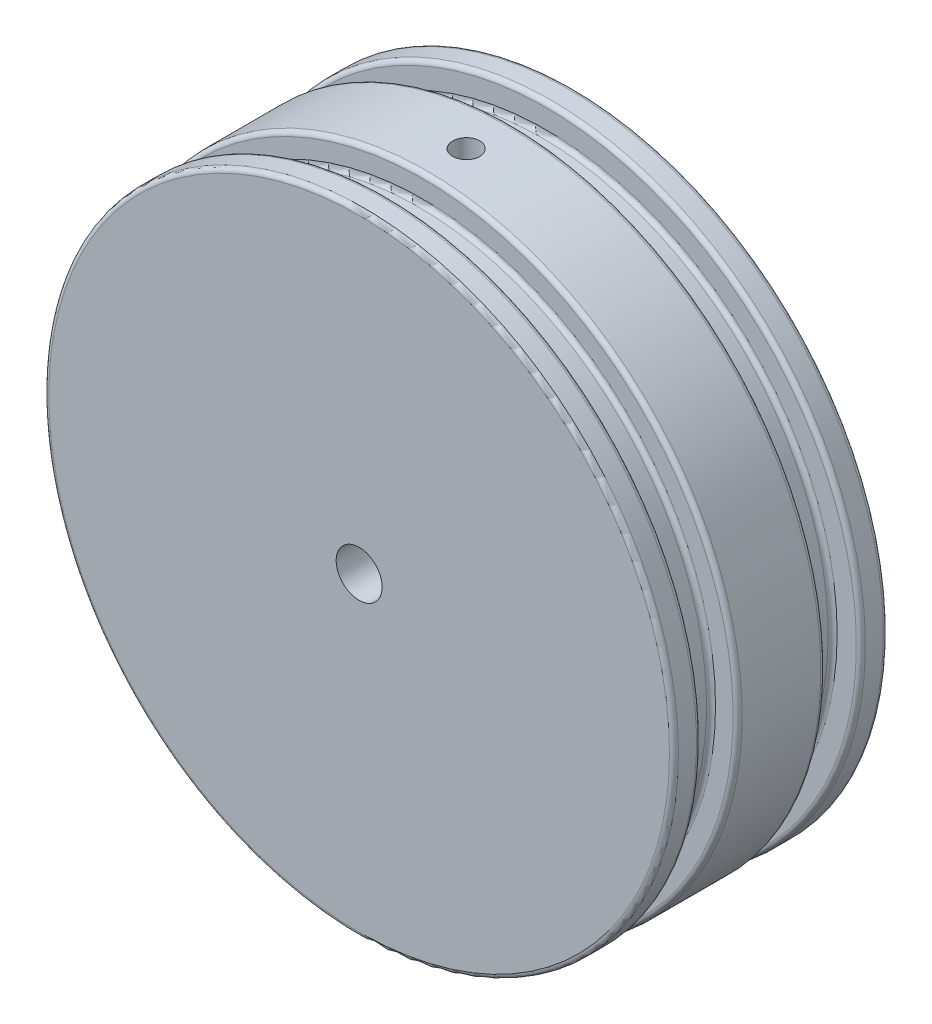
ISO-10303-21;
HEADER;
FILE_DESCRIPTION(('STEP AP214'),'2;1');
FILE_NAME('part.step','',(''),(''),'','','');
FILE_SCHEMA(('AUTOMOTIVE_DESIGN { 1 0 10303 214 1 1 1 1 }'));
ENDSEC;
DATA;
#1=APPLICATION_CONTEXT('core data for automotive mechanical design processes');
#2=APPLICATION_PROTOCOL_DEFINITION('international standard','automotive_design',2000,#1);
#3=PRODUCT_CONTEXT('',#1,'mechanical');
#4=PRODUCT('Part','Part','',(#3));
#5=PRODUCT_RELATED_PRODUCT_CATEGORY('part','',(#4));
#6=PRODUCT_DEFINITION_FORMATION('','',#4);
#7=PRODUCT_DEFINITION_CONTEXT('part definition',#1,'design');
#8=PRODUCT_DEFINITION('design','',#6,#7);
#9=PRODUCT_DEFINITION_SHAPE('','',#8);
#10=(LENGTH_UNIT() NAMED_UNIT(*) SI_UNIT(.MILLI.,.METRE.));
#11=(NAMED_UNIT(*) PLANE_ANGLE_UNIT() SI_UNIT($,.RADIAN.));
#12=(NAMED_UNIT(*) SI_UNIT($,.STERADIAN.) SOLID_ANGLE_UNIT());
#13=UNCERTAINTY_MEASURE_WITH_UNIT(LENGTH_MEASURE(1.E-05),#10,'distance_accuracy_value','');
#14=(GEOMETRIC_REPRESENTATION_CONTEXT(3) GLOBAL_UNCERTAINTY_ASSIGNED_CONTEXT((#13)) GLOBAL_UNIT_ASSIGNED_CONTEXT((#10,
#11,#12)) REPRESENTATION_CONTEXT('',''));
#15=CARTESIAN_POINT('',(0.,0.,0.));
#16=DIRECTION('',(0.,0.,1.));
#17=DIRECTION('',(1.,0.,0.));
#18=AXIS2_PLACEMENT_3D('',#15,#16,#17);
#19=CARTESIAN_POINT('',(0.,0.,20.));
#20=DIRECTION('',(0.,0.,-1.));
#21=DIRECTION('',(-1.,0.,0.));
#22=AXIS2_PLACEMENT_3D('',#19,#20,#21);
#23=CYLINDRICAL_SURFACE('',#22,69.9);
#24=CARTESIAN_POINT('',(0.,0.,19.));
#25=DIRECTION('',(0.,0.,1.));
#26=DIRECTION('',(1.,0.,0.));
#27=AXIS2_PLACEMENT_3D('',#24,#25,#26);
#28=CIRCLE('',#27,69.9);
#29=CARTESIAN_POINT('',(69.9,0.,19.));
#30=VERTEX_POINT('',#29);
#31=EDGE_CURVE('E106',#30,#30,#28,.F.);
#32=ORIENTED_EDGE('',*,*,#31,.T.);
#33=EDGE_LOOP('',(#32));
#34=FACE_BOUND('',#33,.T.);
#35=CARTESIAN_POINT('',(0.,0.,15.));
#36=DIRECTION('',(0.,0.,-1.));
#37=DIRECTION('',(-1.,0.,0.));
#38=AXIS2_PLACEMENT_3D('',#35,#36,#37);
#39=CIRCLE('',#38,69.9);
#40=CARTESIAN_POINT('',(-69.9,0.,15.));
#41=VERTEX_POINT('',#40);
#42=EDGE_CURVE('E103',#41,#41,#39,.F.);
#43=ORIENTED_EDGE('',*,*,#42,.T.);
#44=EDGE_LOOP('',(#43));
#45=FACE_BOUND('',#44,.T.);
#46=ADVANCED_FACE('F38',(#34,#45),#23,.T.);
#47=CARTESIAN_POINT('',(0.,0.,20.));
#48=DIRECTION('',(0.,0.,1.));
#49=DIRECTION('',(1.,0.,0.));
#50=AXIS2_PLACEMENT_3D('',#47,#48,#49);
#51=PLANE('',#50);
#52=CARTESIAN_POINT('',(0.,0.,20.));
#53=DIRECTION('',(0.,0.,1.));
#54=DIRECTION('',(1.,0.,0.));
#55=AXIS2_PLACEMENT_3D('',#52,#53,#54);
#56=CIRCLE('',#55,5.1);
#57=CARTESIAN_POINT('',(5.1,0.,20.));
#58=VERTEX_POINT('',#57);
#59=EDGE_CURVE('E76',#58,#58,#56,.T.);
#60=ORIENTED_EDGE('',*,*,#59,.F.);
#61=EDGE_LOOP('',(#60));
#62=FACE_BOUND('',#61,.T.);
#63=CARTESIAN_POINT('',(0.,0.,20.));
#64=DIRECTION('',(0.,0.,1.));
#65=DIRECTION('',(1.,0.,0.));
#66=AXIS2_PLACEMENT_3D('',#63,#64,#65);
#67=CIRCLE('',#66,68.9);
#68=CARTESIAN_POINT('',(68.9,0.,20.));
#69=VERTEX_POINT('',#68);
#70=EDGE_CURVE('E100',#69,#69,#67,.T.);
#71=ORIENTED_EDGE('',*,*,#70,.T.);
#72=EDGE_LOOP('',(#71));
#73=FACE_BOUND('',#72,.T.);
#74=ADVANCED_FACE('F201',(#62,#73),#51,.T.);
#75=CARTESIAN_POINT('',(0.,0.,5.87000000000001));
#76=DIRECTION('',(0.,0.,-1.));
#77=DIRECTION('',(-1.,0.,0.));
#78=AXIS2_PLACEMENT_3D('',#75,#76,#77);
#79=PLANE('',#78);
#80=CARTESIAN_POINT('',(0.,0.,5.87000000000001));
#81=DIRECTION('',(0.,0.,-1.));
#82=DIRECTION('',(-1.,0.,0.));
#83=AXIS2_PLACEMENT_3D('',#80,#81,#82);
#84=CIRCLE('',#83,68.9);
#85=CARTESIAN_POINT('',(-68.9,0.,5.87000000000002));
#86=VERTEX_POINT('',#85);
#87=EDGE_CURVE('E142',#86,#86,#84,.F.);
#88=ORIENTED_EDGE('',*,*,#87,.T.);
#89=EDGE_LOOP('',(#88));
#90=FACE_BOUND('',#89,.T.);
#91=CARTESIAN_POINT('',(0.,0.,5.87000000000001));
#92=DIRECTION('',(0.,0.,-1.));
#93=DIRECTION('',(-1.,0.,0.));
#94=AXIS2_PLACEMENT_3D('',#91,#92,#93);
#95=CIRCLE('',#94,65.);
#96=CARTESIAN_POINT('',(-65.,0.,5.87000000000002));
#97=VERTEX_POINT('',#96);
#98=EDGE_CURVE('E139',#97,#97,#95,.T.);
#99=ORIENTED_EDGE('',*,*,#98,.T.);
#100=EDGE_LOOP('',(#99));
#101=FACE_BOUND('',#100,.T.);
#102=ADVANCED_FACE('F197',(#90,#101),#79,.F.);
#103=CARTESIAN_POINT('',(0.,0.,0.));
#104=DIRECTION('',(0.,0.,-1.));
#105=DIRECTION('',(-1.,0.,0.));
#106=AXIS2_PLACEMENT_3D('',#103,#104,#105);
#107=CYLINDRICAL_SURFACE('',#106,64.);
#108=CARTESIAN_POINT('',(0.,0.,6.87000000000001));
#109=DIRECTION('',(0.,0.,-1.));
#110=DIRECTION('',(-1.,0.,0.));
#111=AXIS2_PLACEMENT_3D('',#108,#109,#110);
#112=CIRCLE('',#111,64.);
#113=CARTESIAN_POINT('',(-64.,0.,6.87000000000002));
#114=VERTEX_POINT('',#113);
#115=EDGE_CURVE('E148',#114,#114,#112,.F.);
#116=ORIENTED_EDGE('',*,*,#115,.T.);
#117=EDGE_LOOP('',(#116));
#118=FACE_BOUND('',#117,.T.);
#119=CARTESIAN_POINT('',(0.,0.,13.));
#120=DIRECTION('',(0.,0.,-1.));
#121=DIRECTION('',(-1.,0.,0.));
#122=AXIS2_PLACEMENT_3D('',#119,#120,#121);
#123=CIRCLE('',#122,64.);
#124=CARTESIAN_POINT('',(-64.,0.,13.));
#125=VERTEX_POINT('',#124);
#126=EDGE_CURVE('E145',#125,#125,#123,.T.);
#127=ORIENTED_EDGE('',*,*,#126,.T.);
#128=EDGE_LOOP('',(#127));
#129=FACE_BOUND('',#128,.T.);
#130=ADVANCED_FACE('F193',(#118,#129),#107,.T.);
#131=CARTESIAN_POINT('',(0.,0.,14.));
#132=DIRECTION('',(0.,0.,-1.));
#133=DIRECTION('',(-1.,0.,0.));
#134=AXIS2_PLACEMENT_3D('',#131,#132,#133);
#135=PLANE('',#134);
#136=CARTESIAN_POINT('',(0.,0.,14.));
#137=DIRECTION('',(0.,0.,-1.));
#138=DIRECTION('',(-1.,0.,0.));
#139=AXIS2_PLACEMENT_3D('',#136,#137,#138);
#140=CIRCLE('',#139,68.9);
#141=CARTESIAN_POINT('',(-68.9,0.,14.));
#142=VERTEX_POINT('',#141);
#143=EDGE_CURVE('E136',#142,#142,#140,.T.);
#144=ORIENTED_EDGE('',*,*,#143,.T.);
#145=EDGE_LOOP('',(#144));
#146=FACE_BOUND('',#145,.T.);
#147=CARTESIAN_POINT('',(0.,0.,14.));
#148=DIRECTION('',(0.,0.,-1.));
#149=DIRECTION('',(-1.,0.,0.));
#150=AXIS2_PLACEMENT_3D('',#147,#148,#149);
#151=CIRCLE('',#150,65.);
#152=CARTESIAN_POINT('',(-65.,0.,14.));
#153=VERTEX_POINT('',#152);
#154=EDGE_CURVE('E133',#153,#153,#151,.F.);
#155=ORIENTED_EDGE('',*,*,#154,.T.);
#156=EDGE_LOOP('',(#155));
#157=FACE_BOUND('',#156,.T.);
#158=ADVANCED_FACE('F189',(#146,#157),#135,.T.);
#159=CARTESIAN_POINT('',(0.,69.9,-0.750000000000008));
#160=CARTESIAN_POINT('',(-0.168428117413411,69.8999991361935,-0.750007443124612));
#161=CARTESIAN_POINT('',(-0.336976385480152,69.899384719766,-0.764231642353614));
#162=CARTESIAN_POINT('',(-0.669425309317795,69.8969927577005,-0.820774212198047));
#163=CARTESIAN_POINT('',(-0.833320217769736,69.8952138338763,-0.86312587232737));
#164=CARTESIAN_POINT('',(-1.15159833361816,69.8906942482589,-0.974710374824671));
#165=CARTESIAN_POINT('',(-1.30598626376857,69.8879540685913,-1.04392974332557));
#166=CARTESIAN_POINT('',(-1.60090890338736,69.8818207773055,-1.20726463191855));
#167=CARTESIAN_POINT('',(-1.7414469178417,69.8784278220315,-1.30137419265702));
#168=CARTESIAN_POINT('',(-2.00483274017685,69.8713678442757,-1.51190107306887));
#169=CARTESIAN_POINT('',(-2.12766847132002,69.8677006372621,-1.62833349668639));
#170=CARTESIAN_POINT('',(-2.35206027841496,69.8605070745896,-1.88017175461525));
#171=CARTESIAN_POINT('',(-2.45361549416514,69.8569807246291,-2.01557835553228));
#172=CARTESIAN_POINT('',(-2.63259335031651,69.8504653174994,-2.30158021048197));
#173=CARTESIAN_POINT('',(-2.71000708305845,69.8474764588242,-2.4521810437787));
#174=CARTESIAN_POINT('',(-2.83844717509742,69.8423751961116,-2.76425696994728));
#175=CARTESIAN_POINT('',(-2.88947369573528,69.8402627867154,-2.92573199632362));
#176=CARTESIAN_POINT('',(-2.963660420302,69.8371542176156,-3.25486623366148));
#177=CARTESIAN_POINT('',(-2.98683793396597,69.836157364557,-3.4225215363626));
#178=CARTESIAN_POINT('',(-3.00472210560057,69.8353902331509,-3.7593459562245));
#179=CARTESIAN_POINT('',(-2.99942894256305,69.8356199470921,-3.9285150638615));
#180=CARTESIAN_POINT('',(-2.96053648270772,69.8372794004216,-4.26344746521434));
#181=CARTESIAN_POINT('',(-2.92695588192597,69.8387083471976,-4.42921293439039));
#182=CARTESIAN_POINT('',(-2.83247073334638,69.8426039501292,-4.75275170949906));
#183=CARTESIAN_POINT('',(-2.77156609278217,69.8450706098078,-4.9105249882958));
#184=CARTESIAN_POINT('',(-2.62414032048292,69.8507645188183,-5.21366103885525));
#185=CARTESIAN_POINT('',(-2.53761064557077,69.8539920217358,-5.35901965081325));
#186=CARTESIAN_POINT('',(-2.34139731914012,69.8608435588418,-5.63315464041149));
#187=CARTESIAN_POINT('',(-2.23171354963063,69.8644675950509,-5.7619309335445));
#188=CARTESIAN_POINT('',(-1.99219994954676,69.8717072298852,-5.99935464356364));
#189=CARTESIAN_POINT('',(-1.86235392241514,69.8753228193337,-6.10798572227747));
#190=CARTESIAN_POINT('',(-1.58625865920944,69.8821351973169,-6.30190951712028));
#191=CARTESIAN_POINT('',(-1.44000941973757,69.8853319857649,-6.38720222841489));
#192=CARTESIAN_POINT('',(-1.13524983768007,69.8909465444491,-6.53202647658442));
#193=CARTESIAN_POINT('',(-0.976739234757255,69.8933642981389,-6.59155746630113));
#194=CARTESIAN_POINT('',(-0.651960630152949,69.8971480292487,-6.68315782971523));
#195=CARTESIAN_POINT('',(-0.485692671345627,69.898514012481,-6.71522735517057));
#196=CARTESIAN_POINT('',(-0.150260981098907,69.9000394957038,-6.75097436534177));
#197=CARTESIAN_POINT('',(0.018900337406343,69.9001999561607,-6.75467445265988));
#198=CARTESIAN_POINT('',(0.355441570371135,69.8992988560176,-6.73363650587274));
#199=CARTESIAN_POINT('',(0.522821489145164,69.8982372983779,-6.70889854065926));
#200=CARTESIAN_POINT('',(0.850985424272813,69.8950123761206,-6.63170541512932));
#201=CARTESIAN_POINT('',(1.01177186707832,69.8928494208302,-6.57926055162758));
#202=CARTESIAN_POINT('',(1.3222593692645,69.8876653092081,-6.44815278444367));
#203=CARTESIAN_POINT('',(1.47196038182729,69.8846441492523,-6.36948977004026));
#204=CARTESIAN_POINT('',(1.75613145766384,69.8780812932747,-6.18812064271185));
#205=CARTESIAN_POINT('',(1.89059182682259,69.8745392692009,-6.08539935298621));
#206=CARTESIAN_POINT('',(2.14036735600767,69.8673347989738,-5.85885177249695));
#207=CARTESIAN_POINT('',(2.25568242370287,69.8636723522401,-5.73502537995658));
#208=CARTESIAN_POINT('',(2.46396983501092,69.8566371328346,-5.46968548171051));
#209=CARTESIAN_POINT('',(2.55692757218651,69.853264550456,-5.32816050446869));
#210=CARTESIAN_POINT('',(2.71776177867268,69.8471923288432,-5.0314989598616));
#211=CARTESIAN_POINT('',(2.7856383355939,69.8444926872586,-4.87636244004492));
#212=CARTESIAN_POINT('',(2.89435787837278,69.8400721114155,-4.5569360399706));
#213=CARTESIAN_POINT('',(2.93521023215308,69.8383508380355,-4.39264935304621));
#214=CARTESIAN_POINT('',(2.9887523832002,69.8360801326228,-4.05954124336743));
#215=CARTESIAN_POINT('',(3.00144228466765,69.8355306962543,-3.89071983739377));
#216=CARTESIAN_POINT('',(2.99829824046014,69.8356657389186,-3.55348007933611));
#217=CARTESIAN_POINT('',(2.98248728654348,69.8363492233494,-3.38506151201823));
#218=CARTESIAN_POINT('',(2.92283779449667,69.8388709687991,-3.05327202094142));
#219=CARTESIAN_POINT('',(2.87899920195783,69.8407092320597,-2.8899011069819));
#220=CARTESIAN_POINT('',(2.76454318211485,69.8453331249297,-2.5728386349295));
#221=CARTESIAN_POINT('',(2.6939254304966,69.8481187660125,-2.41914719408801));
#222=CARTESIAN_POINT('',(2.52792043988675,69.8543233234356,-2.12580192546943));
#223=CARTESIAN_POINT('',(2.43253401657979,69.8577422189205,-1.98614763562937));
#224=CARTESIAN_POINT('',(2.21961989557612,69.864830989343,-1.72472792811079));
#225=CARTESIAN_POINT('',(2.10207677408399,69.8685010379738,-1.60297507777172));
#226=CARTESIAN_POINT('',(1.84818468181441,69.8756774969962,-1.38089445140144));
#227=CARTESIAN_POINT('',(1.71183107952361,69.8791838668015,-1.28057196750271));
#228=CARTESIAN_POINT('',(1.42410380473245,69.8856397205142,-1.10416533718572));
#229=CARTESIAN_POINT('',(1.27271776343416,69.8885887399401,-1.02810137122253));
#230=CARTESIAN_POINT('',(0.959425871382597,69.8935901493612,-0.902559807448504));
#231=CARTESIAN_POINT('',(0.797532752099496,69.8956436020482,-0.853050683167686));
#232=CARTESIAN_POINT('',(0.528855657617787,69.8980770212409,-0.795065759189129));
#233=CARTESIAN_POINT('',(0.42381350415275,69.8987949857257,-0.778187546707085));
#234=CARTESIAN_POINT('',(0.212530182995867,69.8997567475176,-0.755652322033788));
#235=CARTESIAN_POINT('',(0.106289016045052,69.9000005451177,-0.749995302907843));
#236=CARTESIAN_POINT('',(0.,69.9,-0.750000000000008));
#237=B_SPLINE_CURVE_WITH_KNOTS('',3,(#159,#160,#161,#162,#163,#164,#165,#166,#167,#168,#169,
#170,#171,#172,#173,#174,#175,#176,#177,#178,#179,#180,#181,#182,#183,#184,#185,#186,#187,#188,
#189,#190,#191,#192,#193,#194,#195,#196,#197,#198,#199,#200,#201,#202,#203,#204,#205,#206,#207,
#208,#209,#210,#211,#212,#213,#214,#215,#216,#217,#218,#219,#220,#221,#222,#223,#224,#225,#226,
#227,#228,#229,#230,#231,#232,#233,#234,#235,#236),.UNSPECIFIED.,.T.,.F.,(4,2,2,2,2,2,2,2,2,2,2,
2,2,2,2,2,2,2,2,2,2,2,2,2,2,2,2,2,2,2,2,2,2,2,2,2,2,2,4),(0.,0.504896368404551,1.01039136098932,
1.5156331801056,2.02075414064359,2.52621808660762,3.03170246050977,3.53737312659466,
4.04304070079227,4.54839381109741,5.05374374430986,5.55875993805781,6.06377784637175,
6.56896431344212,7.07415335495504,7.57975033998123,8.08534742973795,8.59095525744242,
9.0965602910317,9.60176245523313,10.1069633955742,10.6119767181991,11.1169921735605,
11.6223270725101,12.1276644084436,12.6333309987634,13.1389958227313,13.6444852663291,
14.149972839621,14.655052816464,15.1601337737974,15.6652208482053,16.1702912911391,
16.6757146325954,17.1812626421514,17.6872301223797,18.1925955701719,18.5112179723665,
18.8298401776526),.UNSPECIFIED.);
#238=CARTESIAN_POINT('',(0.,69.9,-0.750000000000008));
#239=VERTEX_POINT('',#238);
#240=EDGE_CURVE('E66',#239,#239,#237,.T.);
#241=ORIENTED_EDGE('',*,*,#240,.T.);
#242=EDGE_LOOP('',(#241));
#243=FACE_BOUND('',#242,.T.);
#244=CARTESIAN_POINT('',(0.,0.,-12.63));
#245=DIRECTION('',(0.,0.,-1.));
#246=DIRECTION('',(-1.,0.,0.));
#247=AXIS2_PLACEMENT_3D('',#244,#245,#246);
#248=CIRCLE('',#247,69.9);
#249=CARTESIAN_POINT('',(-69.9,0.,-12.63));
#250=VERTEX_POINT('',#249);
#251=EDGE_CURVE('E130',#250,#250,#248,.F.);
#252=ORIENTED_EDGE('',*,*,#251,.T.);
#253=EDGE_LOOP('',(#252));
#254=FACE_BOUND('',#253,.T.);
#255=CARTESIAN_POINT('',(0.,0.,4.87000000000001));
#256=DIRECTION('',(0.,0.,-1.));
#257=DIRECTION('',(-1.,0.,0.));
#258=AXIS2_PLACEMENT_3D('',#255,#256,#257);
#259=CIRCLE('',#258,69.9);
#260=CARTESIAN_POINT('',(-69.9,0.,4.87000000000002));
#261=VERTEX_POINT('',#260);
#262=EDGE_CURVE('E127',#261,#261,#259,.T.);
#263=ORIENTED_EDGE('',*,*,#262,.T.);
#264=EDGE_LOOP('',(#263));
#265=FACE_BOUND('',#264,.T.);
#266=ADVANCED_FACE('F192',(#243,#254,#265),#23,.T.);
#267=CARTESIAN_POINT('',(63.6352,0.,-13.63));
#268=DIRECTION('',(0.,0.,-1.));
#269=DIRECTION('',(-1.,0.,0.));
#270=AXIS2_PLACEMENT_3D('',#267,#268,#269);
#271=PLANE('',#270);
#272=CARTESIAN_POINT('',(0.,0.,-13.63));
#273=DIRECTION('',(0.,0.,-1.));
#274=DIRECTION('',(-1.,0.,0.));
#275=AXIS2_PLACEMENT_3D('',#272,#273,#274);
#276=CIRCLE('',#275,68.9);
#277=CARTESIAN_POINT('',(-68.9,0.,-13.63));
#278=VERTEX_POINT('',#277);
#279=EDGE_CURVE('E124',#278,#278,#276,.T.);
#280=ORIENTED_EDGE('',*,*,#279,.T.);
#281=EDGE_LOOP('',(#280));
#282=FACE_BOUND('',#281,.T.);
#283=CARTESIAN_POINT('',(0.,0.,-13.63));
#284=DIRECTION('',(0.,0.,-1.));
#285=DIRECTION('',(-1.,0.,0.));
#286=AXIS2_PLACEMENT_3D('',#283,#284,#285);
#287=CIRCLE('',#286,64.6352);
#288=CARTESIAN_POINT('',(-64.6352,0.,-13.63));
#289=VERTEX_POINT('',#288);
#290=EDGE_CURVE('E121',#289,#289,#287,.F.);
#291=ORIENTED_EDGE('',*,*,#290,.T.);
#292=EDGE_LOOP('',(#291));
#293=FACE_BOUND('',#292,.T.);
#294=ADVANCED_FACE('F203',(#282,#293),#271,.T.);
#295=CARTESIAN_POINT('',(63.6352,0.,-21.5));
#296=DIRECTION('',(0.,0.,-1.));
#297=DIRECTION('',(-1.,0.,0.));
#298=AXIS2_PLACEMENT_3D('',#295,#296,#297);
#299=PLANE('',#298);
#300=CARTESIAN_POINT('',(0.,0.,-21.5));
#301=DIRECTION('',(0.,0.,-1.));
#302=DIRECTION('',(-1.,0.,0.));
#303=AXIS2_PLACEMENT_3D('',#300,#301,#302);
#304=CIRCLE('',#303,64.6352);
#305=CARTESIAN_POINT('',(-64.6352,0.,-21.5));
#306=VERTEX_POINT('',#305);
#307=EDGE_CURVE('E112',#306,#306,#304,.T.);
#308=ORIENTED_EDGE('',*,*,#307,.T.);
#309=EDGE_LOOP('',(#308));
#310=FACE_BOUND('',#309,.T.);
#311=CARTESIAN_POINT('',(0.,0.,-21.5));
#312=DIRECTION('',(0.,0.,-1.));
#313=DIRECTION('',(-1.,0.,0.));
#314=AXIS2_PLACEMENT_3D('',#311,#312,#313);
#315=CIRCLE('',#314,68.9);
#316=CARTESIAN_POINT('',(-68.9,0.,-21.5));
#317=VERTEX_POINT('',#316);
#318=EDGE_CURVE('E109',#317,#317,#315,.F.);
#319=ORIENTED_EDGE('',*,*,#318,.T.);
#320=EDGE_LOOP('',(#319));
#321=FACE_BOUND('',#320,.T.);
#322=ADVANCED_FACE('F206',(#310,#321),#299,.F.);
#323=CARTESIAN_POINT('',(0.,0.,0.));
#324=DIRECTION('',(0.,0.,-1.));
#325=DIRECTION('',(-1.,0.,0.));
#326=AXIS2_PLACEMENT_3D('',#323,#324,#325);
#327=CYLINDRICAL_SURFACE('',#326,63.6352);
#328=CARTESIAN_POINT('',(0.,0.,-20.5));
#329=DIRECTION('',(0.,0.,-1.));
#330=DIRECTION('',(-1.,0.,0.));
#331=AXIS2_PLACEMENT_3D('',#328,#329,#330);
#332=CIRCLE('',#331,63.6352);
#333=CARTESIAN_POINT('',(-63.6352,0.,-20.5));
#334=VERTEX_POINT('',#333);
#335=EDGE_CURVE('E118',#334,#334,#332,.F.);
#336=ORIENTED_EDGE('',*,*,#335,.T.);
#337=EDGE_LOOP('',(#336));
#338=FACE_BOUND('',#337,.T.);
#339=CARTESIAN_POINT('',(0.,0.,-14.63));
#340=DIRECTION('',(0.,0.,-1.));
#341=DIRECTION('',(-1.,0.,0.));
#342=AXIS2_PLACEMENT_3D('',#339,#340,#341);
#343=CIRCLE('',#342,63.6352);
#344=CARTESIAN_POINT('',(-63.6352,0.,-14.63));
#345=VERTEX_POINT('',#344);
#346=EDGE_CURVE('E115',#345,#345,#343,.T.);
#347=ORIENTED_EDGE('',*,*,#346,.T.);
#348=EDGE_LOOP('',(#347));
#349=FACE_BOUND('',#348,.T.);
#350=ADVANCED_FACE('F210',(#338,#349),#327,.T.);
#351=CARTESIAN_POINT('',(0.,0.,-27.5));
#352=DIRECTION('',(0.,0.,-1.));
#353=DIRECTION('',(-1.,0.,0.));
#354=AXIS2_PLACEMENT_3D('',#351,#352,#353);
#355=PLANE('',#354);
#356=CARTESIAN_POINT('',(0.,42.9,-27.5));
#357=DIRECTION('',(0.,0.,-1.));
#358=DIRECTION('',(-1.,0.,0.));
#359=AXIS2_PLACEMENT_3D('',#356,#357,#358);
#360=CIRCLE('',#359,2.99999999999999);
#361=CARTESIAN_POINT('',(-2.99999999999999,42.9,-27.5));
#362=VERTEX_POINT('',#361);
#363=EDGE_CURVE('E70',#362,#362,#360,.T.);
#364=ORIENTED_EDGE('',*,*,#363,.F.);
#365=EDGE_LOOP('',(#364));
#366=FACE_BOUND('',#365,.T.);
#367=CARTESIAN_POINT('',(0.,0.,-27.5));
#368=DIRECTION('',(0.,0.,-1.));
#369=DIRECTION('',(-1.,0.,0.));
#370=AXIS2_PLACEMENT_3D('',#367,#368,#369);
#371=CIRCLE('',#370,5.1);
#372=CARTESIAN_POINT('',(-5.1,0.,-27.5));
#373=VERTEX_POINT('',#372);
#374=EDGE_CURVE('E85',#373,#373,#371,.T.);
#375=ORIENTED_EDGE('',*,*,#374,.F.);
#376=EDGE_LOOP('',(#375));
#377=FACE_BOUND('',#376,.T.);
#378=CARTESIAN_POINT('',(0.,0.,-27.5));
#379=DIRECTION('',(0.,0.,-1.));
#380=DIRECTION('',(-1.,0.,0.));
#381=AXIS2_PLACEMENT_3D('',#378,#379,#380);
#382=CIRCLE('',#381,68.9);
#383=CARTESIAN_POINT('',(-68.9,0.,-27.5));
#384=VERTEX_POINT('',#383);
#385=EDGE_CURVE('E91',#384,#384,#382,.T.);
#386=ORIENTED_EDGE('',*,*,#385,.T.);
#387=EDGE_LOOP('',(#386));
#388=FACE_BOUND('',#387,.T.);
#389=ADVANCED_FACE('F214',(#366,#377,#388),#355,.T.);
#390=CARTESIAN_POINT('',(0.,0.,-26.5));
#391=DIRECTION('',(0.,0.,-1.));
#392=DIRECTION('',(-1.,0.,0.));
#393=AXIS2_PLACEMENT_3D('',#390,#391,#392);
#394=CIRCLE('',#393,69.9);
#395=CARTESIAN_POINT('',(-69.9,0.,-26.5));
#396=VERTEX_POINT('',#395);
#397=EDGE_CURVE('E97',#396,#396,#394,.F.);
#398=ORIENTED_EDGE('',*,*,#397,.T.);
#399=EDGE_LOOP('',(#398));
#400=FACE_BOUND('',#399,.T.);
#401=CARTESIAN_POINT('',(0.,0.,-22.5));
#402=DIRECTION('',(0.,0.,-1.));
#403=DIRECTION('',(-1.,0.,0.));
#404=AXIS2_PLACEMENT_3D('',#401,#402,#403);
#405=CIRCLE('',#404,69.9);
#406=CARTESIAN_POINT('',(-69.9,0.,-22.5));
#407=VERTEX_POINT('',#406);
#408=EDGE_CURVE('E94',#407,#407,#405,.T.);
#409=ORIENTED_EDGE('',*,*,#408,.T.);
#410=EDGE_LOOP('',(#409));
#411=FACE_BOUND('',#410,.T.);
#412=ADVANCED_FACE('F163',(#400,#411),#23,.T.);
#413=CARTESIAN_POINT('',(0.,0.,-26.5));
#414=DIRECTION('',(0.,0.,-1.));
#415=DIRECTION('',(-1.,0.,0.));
#416=AXIS2_PLACEMENT_3D('',#413,#414,#415);
#417=TOROIDAL_SURFACE('',#416,68.9,1.);
#418=ORIENTED_EDGE('',*,*,#397,.F.);
#419=EDGE_LOOP('',(#418));
#420=FACE_BOUND('',#419,.T.);
#421=ORIENTED_EDGE('',*,*,#385,.F.);
#422=EDGE_LOOP('',(#421));
#423=FACE_BOUND('',#422,.T.);
#424=ADVANCED_FACE('F231',(#420,#423),#417,.T.);
#425=CARTESIAN_POINT('',(0.,0.,19.));
#426=DIRECTION('',(0.,0.,1.));
#427=DIRECTION('',(1.,0.,0.));
#428=AXIS2_PLACEMENT_3D('',#425,#426,#427);
#429=TOROIDAL_SURFACE('',#428,68.9,1.);
#430=ORIENTED_EDGE('',*,*,#31,.F.);
#431=EDGE_LOOP('',(#430));
#432=FACE_BOUND('',#431,.T.);
#433=ORIENTED_EDGE('',*,*,#70,.F.);
#434=EDGE_LOOP('',(#433));
#435=FACE_BOUND('',#434,.T.);
#436=ADVANCED_FACE('F228',(#432,#435),#429,.T.);
#437=CARTESIAN_POINT('',(0.,0.,-20.5));
#438=DIRECTION('',(0.,0.,-1.));
#439=DIRECTION('',(-1.,0.,0.));
#440=AXIS2_PLACEMENT_3D('',#437,#438,#439);
#441=TOROIDAL_SURFACE('',#440,64.6352,1.);
#442=ORIENTED_EDGE('',*,*,#335,.F.);
#443=EDGE_LOOP('',(#442));
#444=FACE_BOUND('',#443,.T.);
#445=ORIENTED_EDGE('',*,*,#307,.F.);
#446=EDGE_LOOP('',(#445));
#447=FACE_BOUND('',#446,.T.);
#448=ADVANCED_FACE('F230',(#444,#447),#441,.F.);
#449=CARTESIAN_POINT('',(0.,0.,-22.5));
#450=DIRECTION('',(0.,0.,-1.));
#451=DIRECTION('',(-1.,0.,0.));
#452=AXIS2_PLACEMENT_3D('',#449,#450,#451);
#453=TOROIDAL_SURFACE('',#452,68.9,1.);
#454=ORIENTED_EDGE('',*,*,#318,.F.);
#455=EDGE_LOOP('',(#454));
#456=FACE_BOUND('',#455,.T.);
#457=ORIENTED_EDGE('',*,*,#408,.F.);
#458=EDGE_LOOP('',(#457));
#459=FACE_BOUND('',#458,.T.);
#460=ADVANCED_FACE('F238',(#456,#459),#453,.T.);
#461=CARTESIAN_POINT('',(0.,0.,-12.63));
#462=DIRECTION('',(0.,0.,-1.));
#463=DIRECTION('',(-1.,0.,0.));
#464=AXIS2_PLACEMENT_3D('',#461,#462,#463);
#465=TOROIDAL_SURFACE('',#464,68.9,1.);
#466=ORIENTED_EDGE('',*,*,#251,.F.);
#467=EDGE_LOOP('',(#466));
#468=FACE_BOUND('',#467,.T.);
#469=ORIENTED_EDGE('',*,*,#279,.F.);
#470=EDGE_LOOP('',(#469));
#471=FACE_BOUND('',#470,.T.);
#472=ADVANCED_FACE('F246',(#468,#471),#465,.T.);
#473=CARTESIAN_POINT('',(0.,0.,-14.63));
#474=DIRECTION('',(0.,0.,-1.));
#475=DIRECTION('',(-1.,0.,0.));
#476=AXIS2_PLACEMENT_3D('',#473,#474,#475);
#477=TOROIDAL_SURFACE('',#476,64.6352,1.);
#478=ORIENTED_EDGE('',*,*,#290,.F.);
#479=EDGE_LOOP('',(#478));
#480=FACE_BOUND('',#479,.T.);
#481=ORIENTED_EDGE('',*,*,#346,.F.);
#482=EDGE_LOOP('',(#481));
#483=FACE_BOUND('',#482,.T.);
#484=ADVANCED_FACE('F250',(#480,#483),#477,.F.);
#485=CARTESIAN_POINT('',(0.,0.,15.));
#486=DIRECTION('',(0.,0.,-1.));
#487=DIRECTION('',(-1.,0.,0.));
#488=AXIS2_PLACEMENT_3D('',#485,#486,#487);
#489=TOROIDAL_SURFACE('',#488,68.9,1.);
#490=ORIENTED_EDGE('',*,*,#42,.F.);
#491=EDGE_LOOP('',(#490));
#492=FACE_BOUND('',#491,.T.);
#493=ORIENTED_EDGE('',*,*,#143,.F.);
#494=EDGE_LOOP('',(#493));
#495=FACE_BOUND('',#494,.T.);
#496=ADVANCED_FACE('F254',(#492,#495),#489,.T.);
#497=CARTESIAN_POINT('',(0.,0.,4.87000000000001));
#498=DIRECTION('',(0.,0.,-1.));
#499=DIRECTION('',(-1.,0.,0.));
#500=AXIS2_PLACEMENT_3D('',#497,#498,#499);
#501=TOROIDAL_SURFACE('',#500,68.9,1.);
#502=ORIENTED_EDGE('',*,*,#87,.F.);
#503=EDGE_LOOP('',(#502));
#504=FACE_BOUND('',#503,.T.);
#505=ORIENTED_EDGE('',*,*,#262,.F.);
#506=EDGE_LOOP('',(#505));
#507=FACE_BOUND('',#506,.T.);
#508=ADVANCED_FACE('F258',(#504,#507),#501,.T.);
#509=CARTESIAN_POINT('',(0.,0.,6.87000000000001));
#510=DIRECTION('',(0.,0.,-1.));
#511=DIRECTION('',(-1.,0.,0.));
#512=AXIS2_PLACEMENT_3D('',#509,#510,#511);
#513=TOROIDAL_SURFACE('',#512,65.,1.);
#514=ORIENTED_EDGE('',*,*,#115,.F.);
#515=EDGE_LOOP('',(#514));
#516=FACE_BOUND('',#515,.T.);
#517=ORIENTED_EDGE('',*,*,#98,.F.);
#518=EDGE_LOOP('',(#517));
#519=FACE_BOUND('',#518,.T.);
#520=ADVANCED_FACE('F261',(#516,#519),#513,.F.);
#521=CARTESIAN_POINT('',(0.,0.,13.));
#522=DIRECTION('',(0.,0.,-1.));
#523=DIRECTION('',(-1.,0.,0.));
#524=AXIS2_PLACEMENT_3D('',#521,#522,#523);
#525=TOROIDAL_SURFACE('',#524,65.,1.);
#526=ORIENTED_EDGE('',*,*,#154,.F.);
#527=EDGE_LOOP('',(#526));
#528=FACE_BOUND('',#527,.T.);
#529=ORIENTED_EDGE('',*,*,#126,.F.);
#530=EDGE_LOOP('',(#529));
#531=FACE_BOUND('',#530,.T.);
#532=ADVANCED_FACE('F40',(#528,#531),#525,.F.);
#533=CARTESIAN_POINT('',(0.,0.,-10.));
#534=DIRECTION('',(0.,0.,-1.));
#535=DIRECTION('',(-1.,0.,0.));
#536=AXIS2_PLACEMENT_3D('',#533,#534,#535);
#537=CONICAL_SURFACE('',#536,5.1,1.02974425867665);
#538=CARTESIAN_POINT('',(0.,0.,-6.93561084295944));
#539=VERTEX_POINT('',#538);
#540=VERTEX_LOOP('',#539);
#541=FACE_BOUND('',#540,.T.);
#542=CARTESIAN_POINT('',(0.,0.,-10.));
#543=DIRECTION('',(0.,0.,-1.));
#544=DIRECTION('',(-1.,0.,0.));
#545=AXIS2_PLACEMENT_3D('',#542,#543,#544);
#546=CIRCLE('',#545,5.1);
#547=CARTESIAN_POINT('',(-5.1,0.,-10.));
#548=VERTEX_POINT('',#547);
#549=EDGE_CURVE('E88',#548,#548,#546,.T.);
#550=ORIENTED_EDGE('',*,*,#549,.T.);
#551=EDGE_LOOP('',(#550));
#552=FACE_BOUND('',#551,.T.);
#553=ADVANCED_FACE('F185',(#541,#552),#537,.F.);
#554=CARTESIAN_POINT('',(0.,0.,-27.5));
#555=DIRECTION('',(0.,0.,-1.));
#556=DIRECTION('',(-1.,0.,0.));
#557=AXIS2_PLACEMENT_3D('',#554,#555,#556);
#558=CYLINDRICAL_SURFACE('',#557,5.1);
#559=ORIENTED_EDGE('',*,*,#549,.F.);
#560=EDGE_LOOP('',(#559));
#561=FACE_BOUND('',#560,.T.);
#562=ORIENTED_EDGE('',*,*,#374,.T.);
#563=EDGE_LOOP('',(#562));
#564=FACE_BOUND('',#563,.T.);
#565=ADVANCED_FACE('F181',(#561,#564),#558,.F.);
#566=CARTESIAN_POINT('',(0.,0.,2.5));
#567=DIRECTION('',(0.,0.,1.));
#568=DIRECTION('',(1.,0.,0.));
#569=AXIS2_PLACEMENT_3D('',#566,#567,#568);
#570=CONICAL_SURFACE('',#569,5.1,1.02974425867665);
#571=CARTESIAN_POINT('',(0.,0.,-0.56438915704056));
#572=VERTEX_POINT('',#571);
#573=VERTEX_LOOP('',#572);
#574=FACE_BOUND('',#573,.T.);
#575=CARTESIAN_POINT('',(0.,0.,2.5));
#576=DIRECTION('',(0.,0.,1.));
#577=DIRECTION('',(1.,0.,0.));
#578=AXIS2_PLACEMENT_3D('',#575,#576,#577);
#579=CIRCLE('',#578,5.1);
#580=CARTESIAN_POINT('',(5.1,0.,2.5));
#581=VERTEX_POINT('',#580);
#582=EDGE_CURVE('E79',#581,#581,#579,.T.);
#583=ORIENTED_EDGE('',*,*,#582,.T.);
#584=EDGE_LOOP('',(#583));
#585=FACE_BOUND('',#584,.T.);
#586=ADVANCED_FACE('F177',(#574,#585),#570,.F.);
#587=CARTESIAN_POINT('',(0.,0.,20.));
#588=DIRECTION('',(0.,0.,1.));
#589=DIRECTION('',(1.,0.,0.));
#590=AXIS2_PLACEMENT_3D('',#587,#588,#589);
#591=CYLINDRICAL_SURFACE('',#590,5.1);
#592=ORIENTED_EDGE('',*,*,#582,.F.);
#593=EDGE_LOOP('',(#592));
#594=FACE_BOUND('',#593,.T.);
#595=ORIENTED_EDGE('',*,*,#59,.T.);
#596=EDGE_LOOP('',(#595));
#597=FACE_BOUND('',#596,.T.);
#598=ADVANCED_FACE('F169',(#594,#597),#591,.F.);
#599=CARTESIAN_POINT('',(0.,69.9,-3.75));
#600=DIRECTION('',(0.,1.,0.));
#601=DIRECTION('',(0.,0.,1.));
#602=AXIS2_PLACEMENT_3D('',#599,#600,#601);
#603=CYLINDRICAL_SURFACE('',#602,2.99999999999999);
#604=CARTESIAN_POINT('',(0.,42.9,-3.75));
#605=DIRECTION('',(0.,1.,0.));
#606=DIRECTION('',(0.,0.,1.));
#607=AXIS2_PLACEMENT_3D('',#604,#605,#606);
#608=CIRCLE('',#607,2.99999999999999);
#609=CARTESIAN_POINT('',(-3.00000000000001,42.9,-3.75000000000001));
#610=VERTEX_POINT('',#609);
#611=CARTESIAN_POINT('',(2.99999999999999,42.9,-3.75));
#612=VERTEX_POINT('',#611);
#613=EDGE_CURVE('E69',#610,#612,#608,.T.);
#614=ORIENTED_EDGE('',*,*,#613,.F.);
#615=CARTESIAN_POINT('',(0.,42.9,-3.75));
#616=DIRECTION('',(0.,0.707106781186547,0.707106781186547));
#617=DIRECTION('',(0.,0.707106781186547,-0.707106781186547));
#618=AXIS2_PLACEMENT_3D('',#615,#616,#617);
#619=ELLIPSE('',#618,4.24264068711927,2.99999999999999);
#620=EDGE_CURVE('E11',#610,#612,#619,.F.);
#621=ORIENTED_EDGE('',*,*,#620,.T.);
#622=EDGE_LOOP('',(#614,#621));
#623=FACE_BOUND('',#622,.T.);
#624=ORIENTED_EDGE('',*,*,#240,.F.);
#625=EDGE_LOOP('',(#624));
#626=FACE_BOUND('',#625,.T.);
#627=ADVANCED_FACE('F73',(#623,#626),#603,.F.);
#628=CARTESIAN_POINT('',(0.,42.9,-3.75));
#629=DIRECTION('',(0.,1.,0.));
#630=DIRECTION('',(0.,0.,1.));
#631=AXIS2_PLACEMENT_3D('',#628,#629,#630);
#632=CONICAL_SURFACE('',#631,2.99999999999999,1.02974425867665);
#633=ORIENTED_EDGE('',*,*,#613,.T.);
#634=CARTESIAN_POINT('',(3.00019999999998,42.90012017357,-3.75012017356994));
#635=CARTESIAN_POINT('',(2.94481919650485,42.8668452681429,-3.71684526814285));
#636=CARTESIAN_POINT('',(2.88920961455658,42.8337610258876,-3.68376102588763));
#637=CARTESIAN_POINT('',(2.77746112410855,42.7680366426177,-3.61803664261766));
#638=CARTESIAN_POINT('',(2.72132217553657,42.7353965356876,-3.58539653568764));
#639=CARTESIAN_POINT('',(2.55181235785797,42.638127130131,-3.48812713013095));
#640=CARTESIAN_POINT('',(2.43754820482402,42.5742694980772,-3.42426949807724));
#641=CARTESIAN_POINT('',(2.20317107248537,42.4478894694494,-3.2978894694494));
#642=CARTESIAN_POINT('',(2.08298354031401,42.3854358666317,-3.23543586663166));
#643=CARTESIAN_POINT('',(1.83844014983975,42.2648172916421,-3.11481729164205));
#644=CARTESIAN_POINT('',(1.71408754549227,42.2066490801799,-3.05664908017988));
#645=CARTESIAN_POINT('',(1.51503617023931,42.1205489394792,-2.97054893947918));
#646=CARTESIAN_POINT('',(1.44221538324392,42.090452598505,-2.94045259850496));
#647=CARTESIAN_POINT('',(1.29451472145342,42.0328550719393,-2.88285507193933));
#648=CARTESIAN_POINT('',(1.21963451571467,42.0053543066348,-2.85535430663478));
#649=CARTESIAN_POINT('',(1.06796645388152,41.9537900324396,-2.80379003243958));
#650=CARTESIAN_POINT('',(0.991189541378506,41.9297105839417,-2.77971058394167));
#651=CARTESIAN_POINT('',(0.83527273327221,41.8857210801732,-2.7357210801732));
#652=CARTESIAN_POINT('',(0.756133726599484,41.8658094784623,-2.71580947846228));
#653=CARTESIAN_POINT('',(0.614838847661192,41.8353177101869,-2.68531771018694));
#654=CARTESIAN_POINT('',(0.553156496787139,41.8236448147268,-2.67364481472676));
#655=CARTESIAN_POINT('',(0.428696132448972,41.8037454604699,-2.65374546046986));
#656=CARTESIAN_POINT('',(0.365918511059437,41.7955177937208,-2.64551779372085));
#657=CARTESIAN_POINT('',(0.239723785449214,41.7828965217945,-2.6328965217945));
#658=CARTESIAN_POINT('',(0.176308336104528,41.7784947540636,-2.62849475406359));
#659=CARTESIAN_POINT('',(0.0491714436306936,41.7737233713001,-2.62372337130015));
#660=CARTESIAN_POINT('',(-0.0145499922482376,41.7733536611968,-2.62335366119683));
#661=CARTESIAN_POINT('',(-0.141798814340133,41.7766668147102,-2.62666681471022));
#662=CARTESIAN_POINT('',(-0.205326132574949,41.7803509640861,-2.63035096408609));
#663=CARTESIAN_POINT('',(-0.331688809153399,41.7915805512674,-2.64158055126743));
#664=CARTESIAN_POINT('',(-0.394524115737512,41.7991262759253,-2.64912627592537));
#665=CARTESIAN_POINT('',(-0.519315121792731,41.8177495950564,-2.66774959505644));
#666=CARTESIAN_POINT('',(-0.581267772876431,41.8288372816896,-2.67883728168963));
#667=CARTESIAN_POINT('',(-0.703885732612654,41.8540957922459,-2.70409579224588));
#668=CARTESIAN_POINT('',(-0.764551015330784,41.8682666782162,-2.71826667821625));
#669=CARTESIAN_POINT('',(-0.961567526195699,41.9191158772262,-2.76911587722624));
#670=CARTESIAN_POINT('',(-1.09506667274704,41.9613279239462,-2.81132792394623));
#671=CARTESIAN_POINT('',(-1.35559890418364,42.0548118420647,-2.90481184206473));
#672=CARTESIAN_POINT('',(-1.4826182942422,42.1061019545257,-2.95610195452574));
#673=CARTESIAN_POINT('',(-1.73220340272004,42.2149876450024,-3.06498764500236));
#674=CARTESIAN_POINT('',(-1.85473487722199,42.2726219754579,-3.12262197545788));
#675=CARTESIAN_POINT('',(-2.09560413534696,42.3919223418482,-3.24192234184817));
#676=CARTESIAN_POINT('',(-2.21394522524762,42.4535850848377,-3.3035850848377));
#677=CARTESIAN_POINT('',(-2.44549853404446,42.5786773272452,-3.4286773272452));
#678=CARTESIAN_POINT('',(-2.5587640707012,42.6420577818363,-3.49205778183632));
#679=CARTESIAN_POINT('',(-2.72628274618481,42.738274165507,-3.58827416550696));
#680=CARTESIAN_POINT('',(-2.78141597227865,42.7703499502653,-3.62034995026527));
#681=CARTESIAN_POINT('',(-2.89117309168948,42.8349292293993,-3.68492922939932));
#682=CARTESIAN_POINT('',(-2.94579701917862,42.8674326947212,-3.71743269472117));
#683=CARTESIAN_POINT('',(-3.00019999999999,42.9001201735699,-3.75012017356995));
#684=B_SPLINE_CURVE_WITH_KNOTS('',3,(#634,#635,#636,#637,#638,#639,#640,#641,#642,#643,#644,
#645,#646,#647,#648,#649,#650,#651,#652,#653,#654,#655,#656,#657,#658,#659,#660,#661,#662,#663,
#664,#665,#666,#667,#668,#669,#670,#671,#672,#673,#674,#675,#676,#677,#678,#679,#680,#681,#682,
#683),.UNSPECIFIED.,.F.,.F.,(4,2,2,2,2,2,2,2,2,2,2,2,2,2,2,2,2,2,2,2,2,2,2,2,4),(0.,
0.218019137162532,0.43605491268008,0.872914518320865,1.32025538949976,1.76725457435416,
2.02021632853454,2.27321897335595,2.52500127284665,2.77668998463074,2.96808062459462,
3.15940410363729,3.35031838506665,3.54122816496986,3.73219851302315,3.9231830491384,
4.11471668793835,4.30625418158068,4.74376563112851,5.18216638910882,5.62341161501542,
6.06430056083729,6.49755931367734,6.71174404301899,6.92591429637624),.UNSPECIFIED.);
#685=EDGE_CURVE('E46',#612,#610,#684,.T.);
#686=ORIENTED_EDGE('',*,*,#685,.T.);
#687=EDGE_LOOP('',(#633,#686));
#688=FACE_BOUND('',#687,.T.);
#689=ADVANCED_FACE('F75',(#688),#632,.F.);
#690=CARTESIAN_POINT('',(0.,42.9,-27.5));
#691=DIRECTION('',(0.,0.,-1.));
#692=DIRECTION('',(-1.,0.,0.));
#693=AXIS2_PLACEMENT_3D('',#690,#691,#692);
#694=CYLINDRICAL_SURFACE('',#693,2.99999999999999);
#695=ORIENTED_EDGE('',*,*,#363,.T.);
#696=EDGE_LOOP('',(#695));
#697=FACE_BOUND('',#696,.T.);
#698=CARTESIAN_POINT('',(0.,42.9,-3.75));
#699=DIRECTION('',(0.,0.,-1.));
#700=DIRECTION('',(-1.,0.,0.));
#701=AXIS2_PLACEMENT_3D('',#698,#699,#700);
#702=CIRCLE('',#701,2.99999999999999);
#703=EDGE_CURVE('E52',#612,#610,#702,.T.);
#704=ORIENTED_EDGE('',*,*,#703,.F.);
#705=ORIENTED_EDGE('',*,*,#620,.F.);
#706=EDGE_LOOP('',(#704,#705));
#707=FACE_BOUND('',#706,.T.);
#708=ADVANCED_FACE('F68',(#697,#707),#694,.F.);
#709=CARTESIAN_POINT('',(0.,42.9,-3.75));
#710=DIRECTION('',(0.,0.,-1.));
#711=DIRECTION('',(-1.,0.,0.));
#712=AXIS2_PLACEMENT_3D('',#709,#710,#711);
#713=CONICAL_SURFACE('',#712,2.99999999999999,1.02974425867665);
#714=ORIENTED_EDGE('',*,*,#703,.T.);
#715=ORIENTED_EDGE('',*,*,#685,.F.);
#716=EDGE_LOOP('',(#714,#715));
#717=FACE_BOUND('',#716,.T.);
#718=ADVANCED_FACE('F62',(#717),#713,.F.);
#719=CLOSED_SHELL('',(#46,#74,#102,#130,#158,#266,#294,#322,#350,#389,#412,#424,#436,#448,#460,
#472,#484,#496,#508,#520,#532,#553,#565,#586,#598,#627,#689,#708,#718));
#720=MANIFOLD_SOLID_BREP('B2',#719);
#721=ADVANCED_BREP_SHAPE_REPRESENTATION('',(#18,#720),#14);
#722=SHAPE_DEFINITION_REPRESENTATION(#9,#721);
ENDSEC;
END-ISO-10303-21;
